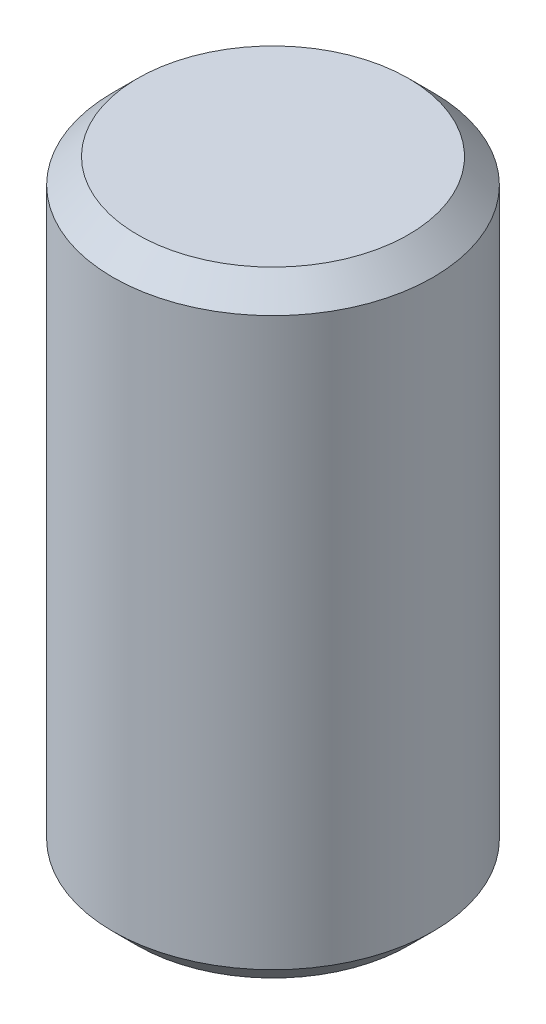
ISO-10303-21;
HEADER;
FILE_DESCRIPTION(('STEP AP214'),'2;1');
FILE_NAME('part.step','',(''),(''),'','','');
FILE_SCHEMA(('AUTOMOTIVE_DESIGN { 1 0 10303 214 1 1 1 1 }'));
ENDSEC;
DATA;
#1=APPLICATION_CONTEXT('core data for automotive mechanical design processes');
#2=APPLICATION_PROTOCOL_DEFINITION('international standard','automotive_design',2000,#1);
#3=PRODUCT_CONTEXT('',#1,'mechanical');
#4=PRODUCT('Part','Part','',(#3));
#5=PRODUCT_RELATED_PRODUCT_CATEGORY('part','',(#4));
#6=PRODUCT_DEFINITION_FORMATION('','',#4);
#7=PRODUCT_DEFINITION_CONTEXT('part definition',#1,'design');
#8=PRODUCT_DEFINITION('design','',#6,#7);
#9=PRODUCT_DEFINITION_SHAPE('','',#8);
#10=(LENGTH_UNIT() NAMED_UNIT(*) SI_UNIT(.MILLI.,.METRE.));
#11=(NAMED_UNIT(*) PLANE_ANGLE_UNIT() SI_UNIT($,.RADIAN.));
#12=(NAMED_UNIT(*) SI_UNIT($,.STERADIAN.) SOLID_ANGLE_UNIT());
#13=UNCERTAINTY_MEASURE_WITH_UNIT(LENGTH_MEASURE(1.E-05),#10,'distance_accuracy_value','');
#14=(GEOMETRIC_REPRESENTATION_CONTEXT(3) GLOBAL_UNCERTAINTY_ASSIGNED_CONTEXT((#13)) GLOBAL_UNIT_ASSIGNED_CONTEXT((#10,
#11,#12)) REPRESENTATION_CONTEXT('',''));
#15=CARTESIAN_POINT('',(0.,0.,0.));
#16=DIRECTION('',(0.,0.,1.));
#17=DIRECTION('',(1.,0.,0.));
#18=AXIS2_PLACEMENT_3D('',#15,#16,#17);
#19=CARTESIAN_POINT('',(0.,-6.35,0.));
#20=DIRECTION('',(0.,1.,0.));
#21=DIRECTION('',(0.,0.,1.));
#22=AXIS2_PLACEMENT_3D('',#19,#20,#21);
#23=PLANE('',#22);
#24=CARTESIAN_POINT('',(0.,-6.35,0.));
#25=DIRECTION('',(0.,1.,0.));
#26=DIRECTION('',(0.,0.,1.));
#27=AXIS2_PLACEMENT_3D('',#24,#25,#26);
#28=CIRCLE('',#27,2.794);
#29=CARTESIAN_POINT('',(0.,-6.35,2.794));
#30=VERTEX_POINT('',#29);
#31=EDGE_CURVE('E38',#30,#30,#28,.F.);
#32=ORIENTED_EDGE('',*,*,#31,.T.);
#33=EDGE_LOOP('',(#32));
#34=FACE_BOUND('',#33,.T.);
#35=ADVANCED_FACE('F31',(#34),#23,.F.);
#36=CARTESIAN_POINT('',(0.,6.08020788678209,0.));
#37=DIRECTION('',(0.,1.,0.));
#38=DIRECTION('',(0.,0.,1.));
#39=AXIS2_PLACEMENT_3D('',#36,#37,#38);
#40=CYLINDRICAL_SURFACE('',#39,3.302);
#41=CARTESIAN_POINT('',(0.,-5.842,0.));
#42=DIRECTION('',(0.,1.,0.));
#43=DIRECTION('',(0.,0.,1.));
#44=AXIS2_PLACEMENT_3D('',#41,#42,#43);
#45=CIRCLE('',#44,3.302);
#46=CARTESIAN_POINT('',(0.,-5.842,3.302));
#47=VERTEX_POINT('',#46);
#48=EDGE_CURVE('E42',#47,#47,#45,.T.);
#49=ORIENTED_EDGE('',*,*,#48,.T.);
#50=EDGE_LOOP('',(#49));
#51=FACE_BOUND('',#50,.T.);
#52=CARTESIAN_POINT('',(0.,5.842,0.));
#53=DIRECTION('',(0.,-1.,0.));
#54=DIRECTION('',(0.,0.,-1.));
#55=AXIS2_PLACEMENT_3D('',#52,#53,#54);
#56=CIRCLE('',#55,3.302);
#57=CARTESIAN_POINT('',(0.,5.842,-3.302));
#58=VERTEX_POINT('',#57);
#59=EDGE_CURVE('E46',#58,#58,#56,.T.);
#60=ORIENTED_EDGE('',*,*,#59,.T.);
#61=EDGE_LOOP('',(#60));
#62=FACE_BOUND('',#61,.T.);
#63=ADVANCED_FACE('F52',(#51,#62),#40,.T.);
#64=CARTESIAN_POINT('',(3.302,6.35,0.));
#65=DIRECTION('',(0.,-1.,0.));
#66=DIRECTION('',(0.,0.,-1.));
#67=AXIS2_PLACEMENT_3D('',#64,#65,#66);
#68=PLANE('',#67);
#69=CARTESIAN_POINT('',(0.,6.35,0.));
#70=DIRECTION('',(0.,-1.,0.));
#71=DIRECTION('',(0.,0.,-1.));
#72=AXIS2_PLACEMENT_3D('',#69,#70,#71);
#73=CIRCLE('',#72,2.794);
#74=CARTESIAN_POINT('',(0.,6.35,-2.794));
#75=VERTEX_POINT('',#74);
#76=EDGE_CURVE('E10',#75,#75,#73,.F.);
#77=ORIENTED_EDGE('',*,*,#76,.T.);
#78=EDGE_LOOP('',(#77));
#79=FACE_BOUND('',#78,.T.);
#80=ADVANCED_FACE('F60',(#79),#68,.F.);
#81=CARTESIAN_POINT('',(0.,-5.842,0.));
#82=DIRECTION('',(0.,1.,0.));
#83=DIRECTION('',(0.,0.,1.));
#84=AXIS2_PLACEMENT_3D('',#81,#82,#83);
#85=CONICAL_SURFACE('',#84,3.302,0.78539816339745);
#86=ORIENTED_EDGE('',*,*,#31,.F.);
#87=EDGE_LOOP('',(#86));
#88=FACE_BOUND('',#87,.T.);
#89=ORIENTED_EDGE('',*,*,#48,.F.);
#90=EDGE_LOOP('',(#89));
#91=FACE_BOUND('',#90,.T.);
#92=ADVANCED_FACE('F56',(#88,#91),#85,.T.);
#93=CARTESIAN_POINT('',(0.,6.35,0.));
#94=DIRECTION('',(0.,-1.,0.));
#95=DIRECTION('',(0.,0.,-1.));
#96=AXIS2_PLACEMENT_3D('',#93,#94,#95);
#97=CONICAL_SURFACE('',#96,2.794,0.785398163397447);
#98=ORIENTED_EDGE('',*,*,#59,.F.);
#99=EDGE_LOOP('',(#98));
#100=FACE_BOUND('',#99,.T.);
#101=ORIENTED_EDGE('',*,*,#76,.F.);
#102=EDGE_LOOP('',(#101));
#103=FACE_BOUND('',#102,.T.);
#104=ADVANCED_FACE('F33',(#100,#103),#97,.T.);
#105=CLOSED_SHELL('',(#35,#63,#80,#92,#104));
#106=MANIFOLD_SOLID_BREP('B2',#105);
#107=ADVANCED_BREP_SHAPE_REPRESENTATION('',(#18,#106),#14);
#108=SHAPE_DEFINITION_REPRESENTATION(#9,#107);
ENDSEC;
END-ISO-10303-21;
